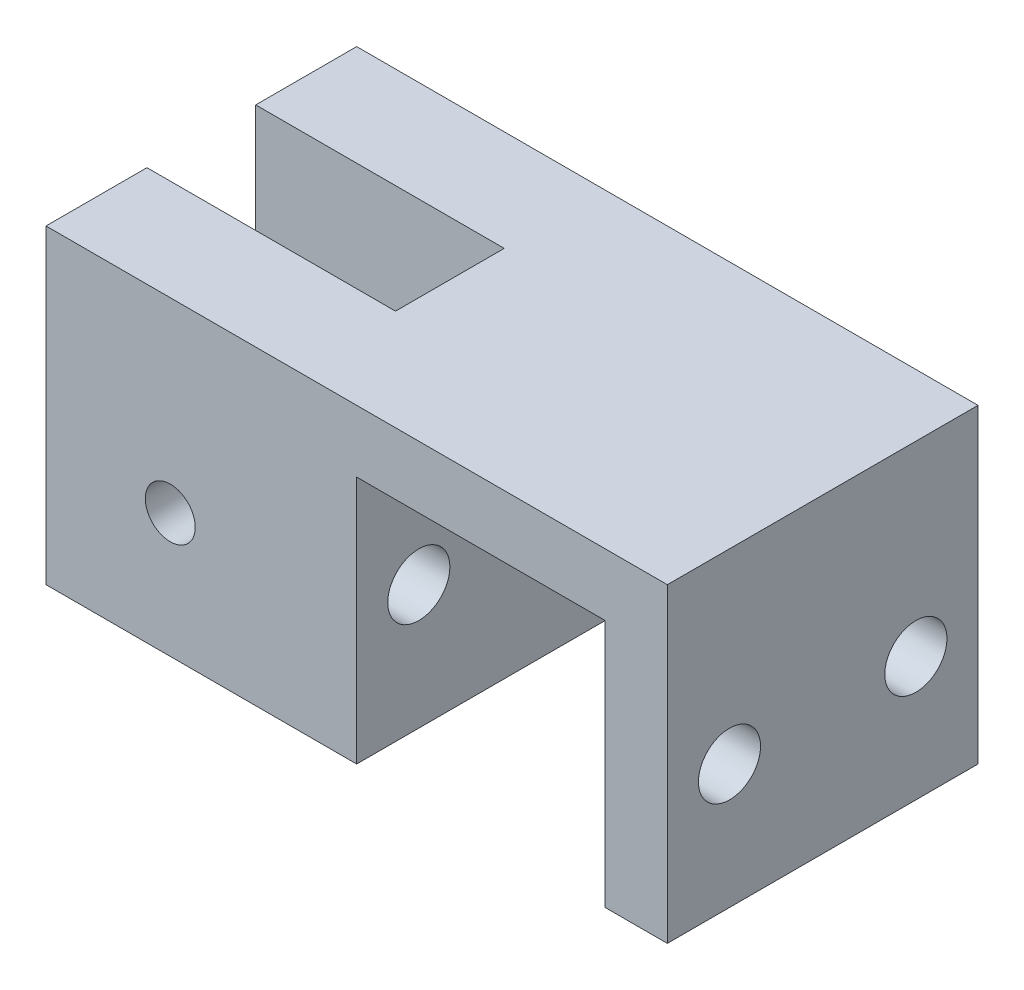
ISO-10303-21;
HEADER;
FILE_DESCRIPTION(('STEP AP214'),'2;1');
FILE_NAME('part.step','',(''),(''),'','','');
FILE_SCHEMA(('AUTOMOTIVE_DESIGN { 1 0 10303 214 1 1 1 1 }'));
ENDSEC;
DATA;
#1=APPLICATION_CONTEXT('core data for automotive mechanical design processes');
#2=APPLICATION_PROTOCOL_DEFINITION('international standard','automotive_design',2000,#1);
#3=PRODUCT_CONTEXT('',#1,'mechanical');
#4=PRODUCT('Part','Part','',(#3));
#5=PRODUCT_RELATED_PRODUCT_CATEGORY('part','',(#4));
#6=PRODUCT_DEFINITION_FORMATION('','',#4);
#7=PRODUCT_DEFINITION_CONTEXT('part definition',#1,'design');
#8=PRODUCT_DEFINITION('design','',#6,#7);
#9=PRODUCT_DEFINITION_SHAPE('','',#8);
#10=(LENGTH_UNIT() NAMED_UNIT(*) SI_UNIT(.MILLI.,.METRE.));
#11=(NAMED_UNIT(*) PLANE_ANGLE_UNIT() SI_UNIT($,.RADIAN.));
#12=(NAMED_UNIT(*) SI_UNIT($,.STERADIAN.) SOLID_ANGLE_UNIT());
#13=UNCERTAINTY_MEASURE_WITH_UNIT(LENGTH_MEASURE(1.E-05),#10,'distance_accuracy_value','');
#14=(GEOMETRIC_REPRESENTATION_CONTEXT(3) GLOBAL_UNCERTAINTY_ASSIGNED_CONTEXT((#13)) GLOBAL_UNIT_ASSIGNED_CONTEXT((#10,
#11,#12)) REPRESENTATION_CONTEXT('',''));
#15=CARTESIAN_POINT('',(0.,0.,0.));
#16=DIRECTION('',(0.,0.,1.));
#17=DIRECTION('',(1.,0.,0.));
#18=AXIS2_PLACEMENT_3D('',#15,#16,#17);
#19=CARTESIAN_POINT('',(31.75,0.,15.875));
#20=DIRECTION('',(-1.,0.,0.));
#21=DIRECTION('',(0.,-1.,0.));
#22=AXIS2_PLACEMENT_3D('',#19,#20,#21);
#23=PLANE('',#22);
#24=CARTESIAN_POINT('',(31.75,12.7,-9.525));
#25=DIRECTION('',(1.,0.,0.));
#26=DIRECTION('',(0.,0.,-1.));
#27=AXIS2_PLACEMENT_3D('',#24,#25,#26);
#28=CIRCLE('',#27,3.17499999999999);
#29=CARTESIAN_POINT('',(31.75,12.7,-12.7));
#30=VERTEX_POINT('',#29);
#31=EDGE_CURVE('E276',#30,#30,#28,.T.);
#32=ORIENTED_EDGE('',*,*,#31,.F.);
#33=EDGE_LOOP('',(#32));
#34=FACE_BOUND('',#33,.T.);
#35=DIRECTION('',(0.,1.,0.));
#36=VECTOR('',#35,1.);
#37=CARTESIAN_POINT('',(31.75,0.,-15.875));
#38=LINE('',#37,#36);
#39=CARTESIAN_POINT('',(31.75,0.,-15.875));
#40=VERTEX_POINT('',#39);
#41=CARTESIAN_POINT('',(31.75,31.75,-15.875));
#42=VERTEX_POINT('',#41);
#43=EDGE_CURVE('E162',#40,#42,#38,.T.);
#44=ORIENTED_EDGE('',*,*,#43,.T.);
#45=DIRECTION('',(0.,0.,-1.));
#46=VECTOR('',#45,1.);
#47=CARTESIAN_POINT('',(31.75,31.75,15.875));
#48=LINE('',#47,#46);
#49=CARTESIAN_POINT('',(31.75,31.75,15.875));
#50=VERTEX_POINT('',#49);
#51=EDGE_CURVE('E159',#50,#42,#48,.T.);
#52=ORIENTED_EDGE('',*,*,#51,.F.);
#53=DIRECTION('',(0.,1.,0.));
#54=VECTOR('',#53,1.);
#55=CARTESIAN_POINT('',(31.75,0.,15.875));
#56=LINE('',#55,#54);
#57=CARTESIAN_POINT('',(31.75,0.,15.875));
#58=VERTEX_POINT('',#57);
#59=EDGE_CURVE('E146',#58,#50,#56,.T.);
#60=ORIENTED_EDGE('',*,*,#59,.F.);
#61=DIRECTION('',(0.,0.,-1.));
#62=VECTOR('',#61,1.);
#63=CARTESIAN_POINT('',(31.75,0.,15.875));
#64=LINE('',#63,#62);
#65=EDGE_CURVE('E166',#58,#40,#64,.T.);
#66=ORIENTED_EDGE('',*,*,#65,.T.);
#67=EDGE_LOOP('',(#44,#52,#60,#66));
#68=FACE_BOUND('',#67,.T.);
#69=CARTESIAN_POINT('',(31.75,12.7,9.525));
#70=DIRECTION('',(1.,0.,0.));
#71=DIRECTION('',(0.,0.,-1.));
#72=AXIS2_PLACEMENT_3D('',#69,#70,#71);
#73=CIRCLE('',#72,3.17499999999999);
#74=CARTESIAN_POINT('',(31.75,12.7,6.35000000000002));
#75=VERTEX_POINT('',#74);
#76=EDGE_CURVE('E288',#75,#75,#73,.T.);
#77=ORIENTED_EDGE('',*,*,#76,.F.);
#78=EDGE_LOOP('',(#77));
#79=FACE_BOUND('',#78,.T.);
#80=ADVANCED_FACE('F59',(#34,#68,#79),#23,.F.);
#81=CARTESIAN_POINT('',(-31.75,31.75,15.875));
#82=DIRECTION('',(1.,0.,0.));
#83=DIRECTION('',(0.,1.,0.));
#84=AXIS2_PLACEMENT_3D('',#81,#82,#83);
#85=PLANE('',#84);
#86=DIRECTION('',(0.,0.,-1.));
#87=VECTOR('',#86,1.);
#88=CARTESIAN_POINT('',(-31.75,0.,15.875));
#89=LINE('',#88,#87);
#90=CARTESIAN_POINT('',(-31.75,0.,-5.55625));
#91=VERTEX_POINT('',#90);
#92=CARTESIAN_POINT('',(-31.75,0.,-15.875));
#93=VERTEX_POINT('',#92);
#94=EDGE_CURVE('E122',#91,#93,#89,.T.);
#95=ORIENTED_EDGE('',*,*,#94,.F.);
#96=DIRECTION('',(0.,1.,0.));
#97=VECTOR('',#96,1.);
#98=CARTESIAN_POINT('',(-31.75,0.,-5.55625));
#99=LINE('',#98,#97);
#100=CARTESIAN_POINT('',(-31.75,31.75,-5.55625));
#101=VERTEX_POINT('',#100);
#102=EDGE_CURVE('E181',#91,#101,#99,.T.);
#103=ORIENTED_EDGE('',*,*,#102,.T.);
#104=DIRECTION('',(0.,0.,-1.));
#105=VECTOR('',#104,1.);
#106=CARTESIAN_POINT('',(-31.75,31.75,15.875));
#107=LINE('',#106,#105);
#108=CARTESIAN_POINT('',(-31.75,31.75,-15.875));
#109=VERTEX_POINT('',#108);
#110=EDGE_CURVE('E201',#101,#109,#107,.T.);
#111=ORIENTED_EDGE('',*,*,#110,.T.);
#112=DIRECTION('',(0.,-1.,0.));
#113=VECTOR('',#112,1.);
#114=CARTESIAN_POINT('',(-31.75,31.75,-15.875));
#115=LINE('',#114,#113);
#116=EDGE_CURVE('E193',#109,#93,#115,.T.);
#117=ORIENTED_EDGE('',*,*,#116,.T.);
#118=EDGE_LOOP('',(#95,#103,#111,#117));
#119=FACE_BOUND('',#118,.T.);
#120=ADVANCED_FACE('F319',(#119),#85,.F.);
#121=CARTESIAN_POINT('',(-31.75,0.,15.875));
#122=DIRECTION('',(0.,1.,0.));
#123=DIRECTION('',(0.,0.,1.));
#124=AXIS2_PLACEMENT_3D('',#121,#122,#123);
#125=PLANE('',#124);
#126=DIRECTION('',(0.,0.,-1.));
#127=VECTOR('',#126,1.);
#128=CARTESIAN_POINT('',(-6.35,0.,-5.55625));
#129=LINE('',#128,#127);
#130=CARTESIAN_POINT('',(-6.35,0.,5.55625));
#131=VERTEX_POINT('',#130);
#132=CARTESIAN_POINT('',(-6.35,0.,-5.55625));
#133=VERTEX_POINT('',#132);
#134=EDGE_CURVE('E262',#131,#133,#129,.T.);
#135=ORIENTED_EDGE('',*,*,#134,.T.);
#136=DIRECTION('',(-1.,0.,0.));
#137=VECTOR('',#136,1.);
#138=CARTESIAN_POINT('',(-31.75,0.,-5.55625));
#139=LINE('',#138,#137);
#140=EDGE_CURVE('E239',#133,#91,#139,.T.);
#141=ORIENTED_EDGE('',*,*,#140,.T.);
#142=ORIENTED_EDGE('',*,*,#94,.T.);
#143=DIRECTION('',(1.,0.,0.));
#144=VECTOR('',#143,1.);
#145=CARTESIAN_POINT('',(-31.75,0.,-15.875));
#146=LINE('',#145,#144);
#147=CARTESIAN_POINT('',(0.,0.,-15.875));
#148=VERTEX_POINT('',#147);
#149=EDGE_CURVE('E177',#93,#148,#146,.T.);
#150=ORIENTED_EDGE('',*,*,#149,.T.);
#151=DIRECTION('',(0.,0.,-1.));
#152=VECTOR('',#151,1.);
#153=CARTESIAN_POINT('',(0.,0.,15.875));
#154=LINE('',#153,#152);
#155=CARTESIAN_POINT('',(0.,0.,15.875));
#156=VERTEX_POINT('',#155);
#157=EDGE_CURVE('E13',#156,#148,#154,.T.);
#158=ORIENTED_EDGE('',*,*,#157,.F.);
#159=DIRECTION('',(1.,0.,0.));
#160=VECTOR('',#159,1.);
#161=CARTESIAN_POINT('',(-31.75,0.,15.875));
#162=LINE('',#161,#160);
#163=CARTESIAN_POINT('',(-31.75,0.,15.875));
#164=VERTEX_POINT('',#163);
#165=EDGE_CURVE('E196',#164,#156,#162,.T.);
#166=ORIENTED_EDGE('',*,*,#165,.F.);
#167=CARTESIAN_POINT('',(-31.75,0.,5.55625));
#168=VERTEX_POINT('',#167);
#169=EDGE_CURVE('E197',#164,#168,#89,.T.);
#170=ORIENTED_EDGE('',*,*,#169,.T.);
#171=DIRECTION('',(1.,0.,0.));
#172=VECTOR('',#171,1.);
#173=CARTESIAN_POINT('',(-31.75,0.,5.55625));
#174=LINE('',#173,#172);
#175=EDGE_CURVE('E77',#168,#131,#174,.T.);
#176=ORIENTED_EDGE('',*,*,#175,.T.);
#177=EDGE_LOOP('',(#135,#141,#142,#150,#158,#166,#170,#176));
#178=FACE_BOUND('',#177,.T.);
#179=ADVANCED_FACE('F61',(#178),#125,.F.);
#180=CARTESIAN_POINT('',(0.,0.,15.875));
#181=DIRECTION('',(-1.,0.,0.));
#182=DIRECTION('',(0.,0.,1.));
#183=AXIS2_PLACEMENT_3D('',#180,#181,#182);
#184=PLANE('',#183);
#185=CARTESIAN_POINT('',(0.,12.7,9.525));
#186=DIRECTION('',(-1.,0.,0.));
#187=DIRECTION('',(0.,0.,1.));
#188=AXIS2_PLACEMENT_3D('',#185,#186,#187);
#189=CIRCLE('',#188,3.17499999999999);
#190=CARTESIAN_POINT('',(0.,12.7,12.7));
#191=VERTEX_POINT('',#190);
#192=EDGE_CURVE('E279',#191,#191,#189,.T.);
#193=ORIENTED_EDGE('',*,*,#192,.T.);
#194=EDGE_LOOP('',(#193));
#195=FACE_BOUND('',#194,.T.);
#196=CARTESIAN_POINT('',(0.,12.7,-9.525));
#197=DIRECTION('',(-1.,0.,0.));
#198=DIRECTION('',(0.,0.,1.));
#199=AXIS2_PLACEMENT_3D('',#196,#197,#198);
#200=CIRCLE('',#199,3.17499999999999);
#201=CARTESIAN_POINT('',(0.,12.7,-6.35000000000001));
#202=VERTEX_POINT('',#201);
#203=EDGE_CURVE('E269',#202,#202,#200,.T.);
#204=ORIENTED_EDGE('',*,*,#203,.T.);
#205=EDGE_LOOP('',(#204));
#206=FACE_BOUND('',#205,.T.);
#207=DIRECTION('',(0.,1.,0.));
#208=VECTOR('',#207,1.);
#209=CARTESIAN_POINT('',(0.,0.,-15.875));
#210=LINE('',#209,#208);
#211=CARTESIAN_POINT('',(0.,25.4,-15.875));
#212=VERTEX_POINT('',#211);
#213=EDGE_CURVE('E180',#148,#212,#210,.T.);
#214=ORIENTED_EDGE('',*,*,#213,.T.);
#215=DIRECTION('',(0.,0.,-1.));
#216=VECTOR('',#215,1.);
#217=CARTESIAN_POINT('',(0.,25.4,15.875));
#218=LINE('',#217,#216);
#219=CARTESIAN_POINT('',(0.,25.4,15.875));
#220=VERTEX_POINT('',#219);
#221=EDGE_CURVE('E68',#220,#212,#218,.T.);
#222=ORIENTED_EDGE('',*,*,#221,.F.);
#223=DIRECTION('',(0.,1.,0.));
#224=VECTOR('',#223,1.);
#225=CARTESIAN_POINT('',(0.,0.,15.875));
#226=LINE('',#225,#224);
#227=EDGE_CURVE('E130',#156,#220,#226,.T.);
#228=ORIENTED_EDGE('',*,*,#227,.F.);
#229=ORIENTED_EDGE('',*,*,#157,.T.);
#230=EDGE_LOOP('',(#214,#222,#228,#229));
#231=FACE_BOUND('',#230,.T.);
#232=ADVANCED_FACE('F339',(#195,#206,#231),#184,.F.);
#233=CARTESIAN_POINT('',(0.,25.4,15.875));
#234=DIRECTION('',(0.,1.,0.));
#235=DIRECTION('',(0.,0.,1.));
#236=AXIS2_PLACEMENT_3D('',#233,#234,#235);
#237=PLANE('',#236);
#238=DIRECTION('',(1.,0.,0.));
#239=VECTOR('',#238,1.);
#240=CARTESIAN_POINT('',(0.,25.4,-15.875));
#241=LINE('',#240,#239);
#242=CARTESIAN_POINT('',(25.4,25.4,-15.875));
#243=VERTEX_POINT('',#242);
#244=EDGE_CURVE('E183',#212,#243,#241,.T.);
#245=ORIENTED_EDGE('',*,*,#244,.T.);
#246=DIRECTION('',(0.,0.,-1.));
#247=VECTOR('',#246,1.);
#248=CARTESIAN_POINT('',(25.4,25.4,15.875));
#249=LINE('',#248,#247);
#250=CARTESIAN_POINT('',(25.4,25.4,15.875));
#251=VERTEX_POINT('',#250);
#252=EDGE_CURVE('E208',#251,#243,#249,.T.);
#253=ORIENTED_EDGE('',*,*,#252,.F.);
#254=DIRECTION('',(1.,0.,0.));
#255=VECTOR('',#254,1.);
#256=CARTESIAN_POINT('',(0.,25.4,15.875));
#257=LINE('',#256,#255);
#258=EDGE_CURVE('E217',#220,#251,#257,.T.);
#259=ORIENTED_EDGE('',*,*,#258,.F.);
#260=ORIENTED_EDGE('',*,*,#221,.T.);
#261=EDGE_LOOP('',(#245,#253,#259,#260));
#262=FACE_BOUND('',#261,.T.);
#263=ADVANCED_FACE('F215',(#262),#237,.F.);
#264=CARTESIAN_POINT('',(25.4,25.4,15.875));
#265=DIRECTION('',(1.,0.,0.));
#266=DIRECTION('',(0.,1.,0.));
#267=AXIS2_PLACEMENT_3D('',#264,#265,#266);
#268=PLANE('',#267);
#269=CARTESIAN_POINT('',(25.4,12.7,9.525));
#270=DIRECTION('',(1.,0.,0.));
#271=DIRECTION('',(0.,1.,0.));
#272=AXIS2_PLACEMENT_3D('',#269,#270,#271);
#273=CIRCLE('',#272,3.17499999999999);
#274=CARTESIAN_POINT('',(25.4,15.875,9.525));
#275=VERTEX_POINT('',#274);
#276=EDGE_CURVE('E282',#275,#275,#273,.T.);
#277=ORIENTED_EDGE('',*,*,#276,.T.);
#278=EDGE_LOOP('',(#277));
#279=FACE_BOUND('',#278,.T.);
#280=CARTESIAN_POINT('',(25.4,12.7,-9.525));
#281=DIRECTION('',(1.,0.,0.));
#282=DIRECTION('',(0.,1.,0.));
#283=AXIS2_PLACEMENT_3D('',#280,#281,#282);
#284=CIRCLE('',#283,3.17499999999999);
#285=CARTESIAN_POINT('',(25.4,15.875,-9.525));
#286=VERTEX_POINT('',#285);
#287=EDGE_CURVE('E259',#286,#286,#284,.T.);
#288=ORIENTED_EDGE('',*,*,#287,.T.);
#289=EDGE_LOOP('',(#288));
#290=FACE_BOUND('',#289,.T.);
#291=DIRECTION('',(0.,-1.,0.));
#292=VECTOR('',#291,1.);
#293=CARTESIAN_POINT('',(25.4,25.4,-15.875));
#294=LINE('',#293,#292);
#295=CARTESIAN_POINT('',(25.4,0.,-15.875));
#296=VERTEX_POINT('',#295);
#297=EDGE_CURVE('E185',#243,#296,#294,.T.);
#298=ORIENTED_EDGE('',*,*,#297,.T.);
#299=DIRECTION('',(0.,0.,-1.));
#300=VECTOR('',#299,1.);
#301=CARTESIAN_POINT('',(25.4,0.,15.875));
#302=LINE('',#301,#300);
#303=CARTESIAN_POINT('',(25.4,0.,15.875));
#304=VERTEX_POINT('',#303);
#305=EDGE_CURVE('E205',#304,#296,#302,.T.);
#306=ORIENTED_EDGE('',*,*,#305,.F.);
#307=DIRECTION('',(0.,-1.,0.));
#308=VECTOR('',#307,1.);
#309=CARTESIAN_POINT('',(25.4,25.4,15.875));
#310=LINE('',#309,#308);
#311=EDGE_CURVE('E229',#251,#304,#310,.T.);
#312=ORIENTED_EDGE('',*,*,#311,.F.);
#313=ORIENTED_EDGE('',*,*,#252,.T.);
#314=EDGE_LOOP('',(#298,#306,#312,#313));
#315=FACE_BOUND('',#314,.T.);
#316=ADVANCED_FACE('F225',(#279,#290,#315),#268,.F.);
#317=CARTESIAN_POINT('',(25.4,0.,15.875));
#318=DIRECTION('',(0.,1.,0.));
#319=DIRECTION('',(0.,0.,1.));
#320=AXIS2_PLACEMENT_3D('',#317,#318,#319);
#321=PLANE('',#320);
#322=DIRECTION('',(1.,0.,0.));
#323=VECTOR('',#322,1.);
#324=CARTESIAN_POINT('',(25.4,0.,-15.875));
#325=LINE('',#324,#323);
#326=EDGE_CURVE('E187',#296,#40,#325,.T.);
#327=ORIENTED_EDGE('',*,*,#326,.T.);
#328=ORIENTED_EDGE('',*,*,#65,.F.);
#329=DIRECTION('',(1.,0.,0.));
#330=VECTOR('',#329,1.);
#331=CARTESIAN_POINT('',(25.4,0.,15.875));
#332=LINE('',#331,#330);
#333=EDGE_CURVE('E153',#304,#58,#332,.T.);
#334=ORIENTED_EDGE('',*,*,#333,.F.);
#335=ORIENTED_EDGE('',*,*,#305,.T.);
#336=EDGE_LOOP('',(#327,#328,#334,#335));
#337=FACE_BOUND('',#336,.T.);
#338=ADVANCED_FACE('F228',(#337),#321,.F.);
#339=CARTESIAN_POINT('',(31.75,31.75,15.875));
#340=DIRECTION('',(0.,-1.,0.));
#341=DIRECTION('',(1.,0.,0.));
#342=AXIS2_PLACEMENT_3D('',#339,#340,#341);
#343=PLANE('',#342);
#344=ORIENTED_EDGE('',*,*,#110,.F.);
#345=DIRECTION('',(-1.,0.,0.));
#346=VECTOR('',#345,1.);
#347=CARTESIAN_POINT('',(-31.75,31.75,-5.55625));
#348=LINE('',#347,#346);
#349=CARTESIAN_POINT('',(-6.35,31.75,-5.55625));
#350=VERTEX_POINT('',#349);
#351=EDGE_CURVE('E248',#350,#101,#348,.T.);
#352=ORIENTED_EDGE('',*,*,#351,.F.);
#353=DIRECTION('',(0.,0.,-1.));
#354=VECTOR('',#353,1.);
#355=CARTESIAN_POINT('',(-6.35,31.75,-5.55625));
#356=LINE('',#355,#354);
#357=CARTESIAN_POINT('',(-6.35,31.75,5.55625));
#358=VERTEX_POINT('',#357);
#359=EDGE_CURVE('E252',#358,#350,#356,.T.);
#360=ORIENTED_EDGE('',*,*,#359,.F.);
#361=DIRECTION('',(1.,0.,0.));
#362=VECTOR('',#361,1.);
#363=CARTESIAN_POINT('',(-31.75,31.75,5.55625));
#364=LINE('',#363,#362);
#365=CARTESIAN_POINT('',(-31.75,31.75,5.55625));
#366=VERTEX_POINT('',#365);
#367=EDGE_CURVE('E255',#366,#358,#364,.T.);
#368=ORIENTED_EDGE('',*,*,#367,.F.);
#369=CARTESIAN_POINT('',(-31.75,31.75,15.875));
#370=VERTEX_POINT('',#369);
#371=EDGE_CURVE('E167',#370,#366,#107,.T.);
#372=ORIENTED_EDGE('',*,*,#371,.F.);
#373=DIRECTION('',(-1.,0.,0.));
#374=VECTOR('',#373,1.);
#375=CARTESIAN_POINT('',(31.75,31.75,15.875));
#376=LINE('',#375,#374);
#377=EDGE_CURVE('E150',#50,#370,#376,.T.);
#378=ORIENTED_EDGE('',*,*,#377,.F.);
#379=ORIENTED_EDGE('',*,*,#51,.T.);
#380=DIRECTION('',(-1.,0.,0.));
#381=VECTOR('',#380,1.);
#382=CARTESIAN_POINT('',(31.75,31.75,-15.875));
#383=LINE('',#382,#381);
#384=EDGE_CURVE('E190',#42,#109,#383,.T.);
#385=ORIENTED_EDGE('',*,*,#384,.T.);
#386=EDGE_LOOP('',(#344,#352,#360,#368,#372,#378,#379,#385));
#387=FACE_BOUND('',#386,.T.);
#388=ADVANCED_FACE('F170',(#387),#343,.F.);
#389=ORIENTED_EDGE('',*,*,#371,.T.);
#390=DIRECTION('',(0.,1.,0.));
#391=VECTOR('',#390,1.);
#392=CARTESIAN_POINT('',(-31.75,0.,5.55625));
#393=LINE('',#392,#391);
#394=EDGE_CURVE('E235',#168,#366,#393,.T.);
#395=ORIENTED_EDGE('',*,*,#394,.F.);
#396=ORIENTED_EDGE('',*,*,#169,.F.);
#397=DIRECTION('',(0.,-1.,0.));
#398=VECTOR('',#397,1.);
#399=CARTESIAN_POINT('',(-31.75,31.75,15.875));
#400=LINE('',#399,#398);
#401=EDGE_CURVE('E86',#370,#164,#400,.T.);
#402=ORIENTED_EDGE('',*,*,#401,.F.);
#403=EDGE_LOOP('',(#389,#395,#396,#402));
#404=FACE_BOUND('',#403,.T.);
#405=ADVANCED_FACE('F306',(#404),#85,.F.);
#406=CARTESIAN_POINT('',(0.,0.,15.875));
#407=DIRECTION('',(0.,0.,1.));
#408=DIRECTION('',(1.,0.,0.));
#409=AXIS2_PLACEMENT_3D('',#406,#407,#408);
#410=PLANE('',#409);
#411=CARTESIAN_POINT('',(-19.05,12.7,15.875));
#412=DIRECTION('',(0.,0.,1.));
#413=DIRECTION('',(1.,0.,0.));
#414=AXIS2_PLACEMENT_3D('',#411,#412,#413);
#415=CIRCLE('',#414,2.55269999999999);
#416=CARTESIAN_POINT('',(-16.4973,12.7,15.875));
#417=VERTEX_POINT('',#416);
#418=EDGE_CURVE('E298',#417,#417,#415,.T.);
#419=ORIENTED_EDGE('',*,*,#418,.F.);
#420=EDGE_LOOP('',(#419));
#421=FACE_BOUND('',#420,.T.);
#422=ORIENTED_EDGE('',*,*,#165,.T.);
#423=ORIENTED_EDGE('',*,*,#227,.T.);
#424=ORIENTED_EDGE('',*,*,#258,.T.);
#425=ORIENTED_EDGE('',*,*,#311,.T.);
#426=ORIENTED_EDGE('',*,*,#333,.T.);
#427=ORIENTED_EDGE('',*,*,#59,.T.);
#428=ORIENTED_EDGE('',*,*,#377,.T.);
#429=ORIENTED_EDGE('',*,*,#401,.T.);
#430=EDGE_LOOP('',(#422,#423,#424,#425,#426,#427,#428,#429));
#431=FACE_BOUND('',#430,.T.);
#432=ADVANCED_FACE('F148',(#421,#431),#410,.T.);
#433=CARTESIAN_POINT('',(0.,0.,-15.875));
#434=DIRECTION('',(0.,0.,1.));
#435=DIRECTION('',(1.,0.,0.));
#436=AXIS2_PLACEMENT_3D('',#433,#434,#435);
#437=PLANE('',#436);
#438=CARTESIAN_POINT('',(-19.05,12.7,-15.875));
#439=DIRECTION('',(0.,0.,1.));
#440=DIRECTION('',(1.,0.,0.));
#441=AXIS2_PLACEMENT_3D('',#438,#439,#440);
#442=CIRCLE('',#441,2.55269999999999);
#443=CARTESIAN_POINT('',(-16.4973,12.7,-15.875));
#444=VERTEX_POINT('',#443);
#445=EDGE_CURVE('E294',#444,#444,#442,.T.);
#446=ORIENTED_EDGE('',*,*,#445,.T.);
#447=EDGE_LOOP('',(#446));
#448=FACE_BOUND('',#447,.T.);
#449=ORIENTED_EDGE('',*,*,#149,.F.);
#450=ORIENTED_EDGE('',*,*,#116,.F.);
#451=ORIENTED_EDGE('',*,*,#384,.F.);
#452=ORIENTED_EDGE('',*,*,#43,.F.);
#453=ORIENTED_EDGE('',*,*,#326,.F.);
#454=ORIENTED_EDGE('',*,*,#297,.F.);
#455=ORIENTED_EDGE('',*,*,#244,.F.);
#456=ORIENTED_EDGE('',*,*,#213,.F.);
#457=EDGE_LOOP('',(#449,#450,#451,#452,#453,#454,#455,#456));
#458=FACE_BOUND('',#457,.T.);
#459=ADVANCED_FACE('F221',(#448,#458),#437,.F.);
#460=CARTESIAN_POINT('',(-31.75,0.,-5.55625));
#461=DIRECTION('',(0.,0.,-1.));
#462=DIRECTION('',(-1.,0.,0.));
#463=AXIS2_PLACEMENT_3D('',#460,#461,#462);
#464=PLANE('',#463);
#465=CARTESIAN_POINT('',(-19.05,12.7,-5.55625));
#466=DIRECTION('',(0.,0.,-1.));
#467=DIRECTION('',(-1.,0.,0.));
#468=AXIS2_PLACEMENT_3D('',#465,#466,#467);
#469=CIRCLE('',#468,2.55269999999999);
#470=CARTESIAN_POINT('',(-21.6027,12.7,-5.55625));
#471=VERTEX_POINT('',#470);
#472=EDGE_CURVE('E63',#471,#471,#469,.T.);
#473=ORIENTED_EDGE('',*,*,#472,.T.);
#474=EDGE_LOOP('',(#473));
#475=FACE_BOUND('',#474,.T.);
#476=ORIENTED_EDGE('',*,*,#351,.T.);
#477=ORIENTED_EDGE('',*,*,#102,.F.);
#478=ORIENTED_EDGE('',*,*,#140,.F.);
#479=DIRECTION('',(0.,1.,0.));
#480=VECTOR('',#479,1.);
#481=CARTESIAN_POINT('',(-6.35,0.,-5.55625));
#482=LINE('',#481,#480);
#483=EDGE_CURVE('E242',#133,#350,#482,.T.);
#484=ORIENTED_EDGE('',*,*,#483,.T.);
#485=EDGE_LOOP('',(#476,#477,#478,#484));
#486=FACE_BOUND('',#485,.T.);
#487=ADVANCED_FACE('F313',(#475,#486),#464,.F.);
#488=CARTESIAN_POINT('',(-6.35,0.,-5.55625));
#489=DIRECTION('',(1.,0.,0.));
#490=DIRECTION('',(0.,1.,0.));
#491=AXIS2_PLACEMENT_3D('',#488,#489,#490);
#492=PLANE('',#491);
#493=ORIENTED_EDGE('',*,*,#359,.T.);
#494=ORIENTED_EDGE('',*,*,#483,.F.);
#495=ORIENTED_EDGE('',*,*,#134,.F.);
#496=DIRECTION('',(0.,1.,0.));
#497=VECTOR('',#496,1.);
#498=CARTESIAN_POINT('',(-6.35,0.,5.55625));
#499=LINE('',#498,#497);
#500=EDGE_CURVE('E238',#131,#358,#499,.T.);
#501=ORIENTED_EDGE('',*,*,#500,.T.);
#502=EDGE_LOOP('',(#493,#494,#495,#501));
#503=FACE_BOUND('',#502,.T.);
#504=ADVANCED_FACE('F390',(#503),#492,.F.);
#505=CARTESIAN_POINT('',(-31.75,0.,5.55625));
#506=DIRECTION('',(0.,0.,1.));
#507=DIRECTION('',(1.,0.,0.));
#508=AXIS2_PLACEMENT_3D('',#505,#506,#507);
#509=PLANE('',#508);
#510=CARTESIAN_POINT('',(-19.05,12.7,5.55625));
#511=DIRECTION('',(0.,0.,1.));
#512=DIRECTION('',(1.,0.,0.));
#513=AXIS2_PLACEMENT_3D('',#510,#511,#512);
#514=CIRCLE('',#513,2.55269999999999);
#515=CARTESIAN_POINT('',(-16.4973,12.7,5.55625));
#516=VERTEX_POINT('',#515);
#517=EDGE_CURVE('E291',#516,#516,#514,.T.);
#518=ORIENTED_EDGE('',*,*,#517,.T.);
#519=EDGE_LOOP('',(#518));
#520=FACE_BOUND('',#519,.T.);
#521=ORIENTED_EDGE('',*,*,#367,.T.);
#522=ORIENTED_EDGE('',*,*,#500,.F.);
#523=ORIENTED_EDGE('',*,*,#175,.F.);
#524=ORIENTED_EDGE('',*,*,#394,.T.);
#525=EDGE_LOOP('',(#521,#522,#523,#524));
#526=FACE_BOUND('',#525,.T.);
#527=ADVANCED_FACE('F382',(#520,#526),#509,.F.);
#528=CARTESIAN_POINT('',(31.75,12.7,-9.525));
#529=DIRECTION('',(1.,0.,0.));
#530=DIRECTION('',(0.,0.,-1.));
#531=AXIS2_PLACEMENT_3D('',#528,#529,#530);
#532=CYLINDRICAL_SURFACE('',#531,3.17499999999999);
#533=ORIENTED_EDGE('',*,*,#31,.T.);
#534=EDGE_LOOP('',(#533));
#535=FACE_BOUND('',#534,.T.);
#536=ORIENTED_EDGE('',*,*,#287,.F.);
#537=EDGE_LOOP('',(#536));
#538=FACE_BOUND('',#537,.T.);
#539=ADVANCED_FACE('F378',(#535,#538),#532,.F.);
#540=CARTESIAN_POINT('',(-12.7,12.7,-9.525));
#541=DIRECTION('',(1.,0.,0.));
#542=DIRECTION('',(0.,0.,-1.));
#543=AXIS2_PLACEMENT_3D('',#540,#541,#542);
#544=CIRCLE('',#543,3.17499999999999);
#545=CARTESIAN_POINT('',(-12.7,12.7,-12.7));
#546=VERTEX_POINT('',#545);
#547=EDGE_CURVE('E272',#546,#546,#544,.T.);
#548=ORIENTED_EDGE('',*,*,#547,.F.);
#549=EDGE_LOOP('',(#548));
#550=FACE_BOUND('',#549,.T.);
#551=ORIENTED_EDGE('',*,*,#203,.F.);
#552=EDGE_LOOP('',(#551));
#553=FACE_BOUND('',#552,.T.);
#554=ADVANCED_FACE('F381',(#550,#553),#532,.F.);
#555=CARTESIAN_POINT('',(-12.7,12.7,-9.525));
#556=DIRECTION('',(1.,0.,0.));
#557=DIRECTION('',(0.,0.,-1.));
#558=AXIS2_PLACEMENT_3D('',#555,#556,#557);
#559=CONICAL_SURFACE('',#558,3.17499999999999,1.02974425867665);
#560=CARTESIAN_POINT('',(-14.6077324654125,12.7,-9.525));
#561=VERTEX_POINT('',#560);
#562=VERTEX_LOOP('',#561);
#563=FACE_BOUND('',#562,.T.);
#564=ORIENTED_EDGE('',*,*,#547,.T.);
#565=EDGE_LOOP('',(#564));
#566=FACE_BOUND('',#565,.T.);
#567=ADVANCED_FACE('F384',(#563,#566),#559,.F.);
#568=CARTESIAN_POINT('',(31.75,12.7,9.525));
#569=DIRECTION('',(1.,0.,0.));
#570=DIRECTION('',(0.,0.,-1.));
#571=AXIS2_PLACEMENT_3D('',#568,#569,#570);
#572=CYLINDRICAL_SURFACE('',#571,3.17499999999999);
#573=ORIENTED_EDGE('',*,*,#76,.T.);
#574=EDGE_LOOP('',(#573));
#575=FACE_BOUND('',#574,.T.);
#576=ORIENTED_EDGE('',*,*,#276,.F.);
#577=EDGE_LOOP('',(#576));
#578=FACE_BOUND('',#577,.T.);
#579=ADVANCED_FACE('F375',(#575,#578),#572,.F.);
#580=CARTESIAN_POINT('',(-12.7,12.7,9.525));
#581=DIRECTION('',(1.,0.,0.));
#582=DIRECTION('',(0.,0.,-1.));
#583=AXIS2_PLACEMENT_3D('',#580,#581,#582);
#584=CIRCLE('',#583,3.17499999999999);
#585=CARTESIAN_POINT('',(-12.7,12.7,6.35000000000001));
#586=VERTEX_POINT('',#585);
#587=EDGE_CURVE('E285',#586,#586,#584,.T.);
#588=ORIENTED_EDGE('',*,*,#587,.F.);
#589=EDGE_LOOP('',(#588));
#590=FACE_BOUND('',#589,.T.);
#591=ORIENTED_EDGE('',*,*,#192,.F.);
#592=EDGE_LOOP('',(#591));
#593=FACE_BOUND('',#592,.T.);
#594=ADVANCED_FACE('F369',(#590,#593),#572,.F.);
#595=CARTESIAN_POINT('',(-12.7,12.7,9.525));
#596=DIRECTION('',(1.,0.,0.));
#597=DIRECTION('',(0.,0.,-1.));
#598=AXIS2_PLACEMENT_3D('',#595,#596,#597);
#599=CONICAL_SURFACE('',#598,3.17499999999999,1.02974425867665);
#600=CARTESIAN_POINT('',(-14.6077324654125,12.7,9.525));
#601=VERTEX_POINT('',#600);
#602=VERTEX_LOOP('',#601);
#603=FACE_BOUND('',#602,.T.);
#604=ORIENTED_EDGE('',*,*,#587,.T.);
#605=EDGE_LOOP('',(#604));
#606=FACE_BOUND('',#605,.T.);
#607=ADVANCED_FACE('F362',(#603,#606),#599,.F.);
#608=CARTESIAN_POINT('',(-19.05,12.7,15.875));
#609=DIRECTION('',(0.,0.,1.));
#610=DIRECTION('',(1.,0.,0.));
#611=AXIS2_PLACEMENT_3D('',#608,#609,#610);
#612=CYLINDRICAL_SURFACE('',#611,2.55269999999999);
#613=ORIENTED_EDGE('',*,*,#445,.F.);
#614=EDGE_LOOP('',(#613));
#615=FACE_BOUND('',#614,.T.);
#616=ORIENTED_EDGE('',*,*,#472,.F.);
#617=EDGE_LOOP('',(#616));
#618=FACE_BOUND('',#617,.T.);
#619=ADVANCED_FACE('F360',(#615,#618),#612,.F.);
#620=ORIENTED_EDGE('',*,*,#418,.T.);
#621=EDGE_LOOP('',(#620));
#622=FACE_BOUND('',#621,.T.);
#623=ORIENTED_EDGE('',*,*,#517,.F.);
#624=EDGE_LOOP('',(#623));
#625=FACE_BOUND('',#624,.T.);
#626=ADVANCED_FACE('F302',(#622,#625),#612,.F.);
#627=CLOSED_SHELL('',(#80,#120,#179,#232,#263,#316,#338,#388,#405,#432,#459,#487,#504,#527,#539,
#554,#567,#579,#594,#607,#619,#626));
#628=MANIFOLD_SOLID_BREP('B2',#627);
#629=ADVANCED_BREP_SHAPE_REPRESENTATION('',(#18,#628),#14);
#630=SHAPE_DEFINITION_REPRESENTATION(#9,#629);
ENDSEC;
END-ISO-10303-21;
